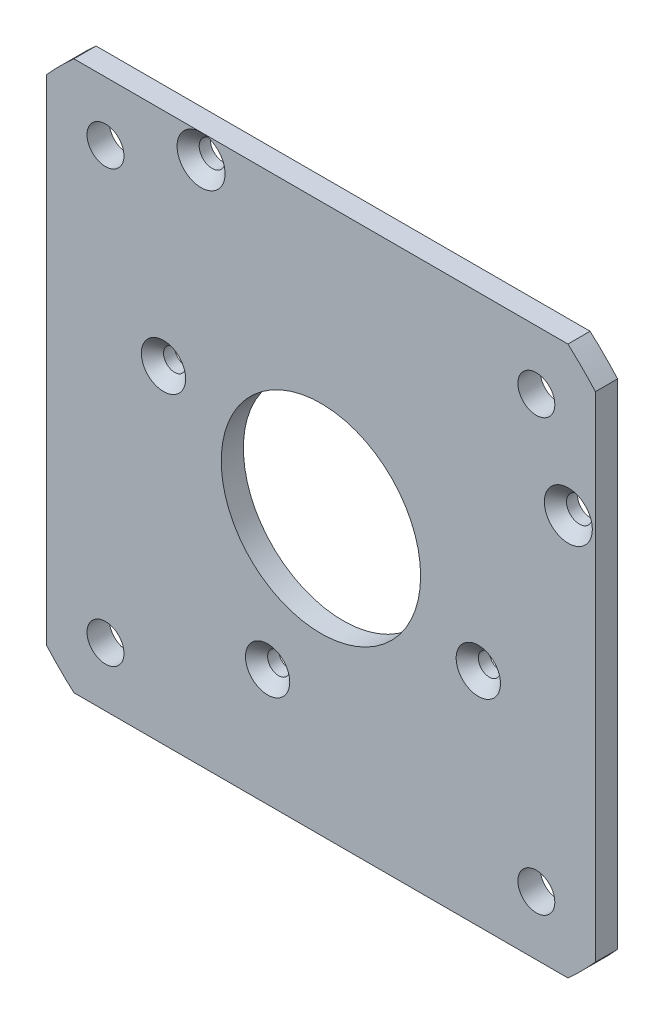
ISO-10303-21;
HEADER;
FILE_DESCRIPTION(('STEP AP214'),'2;1');
FILE_NAME('part.step','',(''),(''),'','','');
FILE_SCHEMA(('AUTOMOTIVE_DESIGN { 1 0 10303 214 1 1 1 1 }'));
ENDSEC;
DATA;
#1=APPLICATION_CONTEXT('core data for automotive mechanical design processes');
#2=APPLICATION_PROTOCOL_DEFINITION('international standard','automotive_design',2000,#1);
#3=PRODUCT_CONTEXT('',#1,'mechanical');
#4=PRODUCT('Part','Part','',(#3));
#5=PRODUCT_RELATED_PRODUCT_CATEGORY('part','',(#4));
#6=PRODUCT_DEFINITION_FORMATION('','',#4);
#7=PRODUCT_DEFINITION_CONTEXT('part definition',#1,'design');
#8=PRODUCT_DEFINITION('design','',#6,#7);
#9=PRODUCT_DEFINITION_SHAPE('','',#8);
#10=(LENGTH_UNIT() NAMED_UNIT(*) SI_UNIT(.MILLI.,.METRE.));
#11=(NAMED_UNIT(*) PLANE_ANGLE_UNIT() SI_UNIT($,.RADIAN.));
#12=(NAMED_UNIT(*) SI_UNIT($,.STERADIAN.) SOLID_ANGLE_UNIT());
#13=UNCERTAINTY_MEASURE_WITH_UNIT(LENGTH_MEASURE(1.E-05),#10,'distance_accuracy_value','');
#14=(GEOMETRIC_REPRESENTATION_CONTEXT(3) GLOBAL_UNCERTAINTY_ASSIGNED_CONTEXT((#13)) GLOBAL_UNIT_ASSIGNED_CONTEXT((#10,
#11,#12)) REPRESENTATION_CONTEXT('',''));
#15=CARTESIAN_POINT('',(0.,0.,0.));
#16=DIRECTION('',(0.,0.,1.));
#17=DIRECTION('',(1.,0.,0.));
#18=AXIS2_PLACEMENT_3D('',#15,#16,#17);
#19=CARTESIAN_POINT('',(0.,-1.66533453693773E-13,-6.00000000000001));
#20=DIRECTION('',(0.,0.,0.999999999999999));
#21=DIRECTION('',(1.,0.,0.));
#22=AXIS2_PLACEMENT_3D('',#19,#20,#21);
#23=CYLINDRICAL_SURFACE('',#22,100.);
#24=CARTESIAN_POINT('',(0.,-1.66533453693773E-13,0.));
#25=DIRECTION('',(0.,0.,0.999999999999999));
#26=DIRECTION('',(1.,0.,0.));
#27=AXIS2_PLACEMENT_3D('',#24,#25,#26);
#28=CIRCLE('',#27,100.);
#29=CARTESIAN_POINT('',(66.8888114535424,-74.3363094478902,1.38777878078145E-13));
#30=VERTEX_POINT('',#29);
#31=CARTESIAN_POINT('',(74.3363094478901,-66.8888114535425,1.38777878078145E-13));
#32=VERTEX_POINT('',#31);
#33=EDGE_CURVE('E144',#30,#32,#28,.T.);
#34=ORIENTED_EDGE('',*,*,#33,.F.);
#35=DIRECTION('',(0.,0.,0.999999999999999));
#36=VECTOR('',#35,1.);
#37=CARTESIAN_POINT('',(66.8888114535423,-74.3363094478902,-5.99999999999987));
#38=LINE('',#37,#36);
#39=CARTESIAN_POINT('',(66.8888114535423,-74.3363094478902,-5.99999999999987));
#40=VERTEX_POINT('',#39);
#41=EDGE_CURVE('E59',#40,#30,#38,.T.);
#42=ORIENTED_EDGE('',*,*,#41,.F.);
#43=CARTESIAN_POINT('',(0.,-1.66533453693773E-13,-6.00000000000001));
#44=DIRECTION('',(0.,0.,0.999999999999999));
#45=DIRECTION('',(1.,0.,0.));
#46=AXIS2_PLACEMENT_3D('',#43,#44,#45);
#47=CIRCLE('',#46,100.);
#48=CARTESIAN_POINT('',(74.3363094478901,-66.8888114535425,-5.99999999999987));
#49=VERTEX_POINT('',#48);
#50=EDGE_CURVE('E167',#40,#49,#47,.T.);
#51=ORIENTED_EDGE('',*,*,#50,.T.);
#52=DIRECTION('',(0.,0.,0.999999999999999));
#53=VECTOR('',#52,1.);
#54=CARTESIAN_POINT('',(74.3363094478901,-66.8888114535425,-5.99999999999987));
#55=LINE('',#54,#53);
#56=EDGE_CURVE('E97',#49,#32,#55,.T.);
#57=ORIENTED_EDGE('',*,*,#56,.T.);
#58=EDGE_LOOP('',(#34,#42,#51,#57));
#59=FACE_BOUND('',#58,.T.);
#60=ADVANCED_FACE('F38',(#59),#23,.T.);
#61=CARTESIAN_POINT('',(-66.8888114535423,-74.3363094478902,-5.99999999999998));
#62=DIRECTION('',(0.,-1.,0.));
#63=DIRECTION('',(0.,0.,-0.999999999999999));
#64=AXIS2_PLACEMENT_3D('',#61,#62,#63);
#65=PLANE('',#64);
#66=DIRECTION('',(1.,0.,0.));
#67=VECTOR('',#66,1.);
#68=CARTESIAN_POINT('',(-66.8888114535423,-74.3363094478902,0.));
#69=LINE('',#68,#67);
#70=CARTESIAN_POINT('',(-66.8888114535423,-74.3363094478902,0.));
#71=VERTEX_POINT('',#70);
#72=EDGE_CURVE('E164',#71,#30,#69,.T.);
#73=ORIENTED_EDGE('',*,*,#72,.F.);
#74=DIRECTION('',(0.,0.,0.999999999999999));
#75=VECTOR('',#74,1.);
#76=CARTESIAN_POINT('',(-66.8888114535423,-74.3363094478902,-5.99999999999998));
#77=LINE('',#76,#75);
#78=CARTESIAN_POINT('',(-66.8888114535423,-74.3363094478902,-5.99999999999998));
#79=VERTEX_POINT('',#78);
#80=EDGE_CURVE('E125',#79,#71,#77,.T.);
#81=ORIENTED_EDGE('',*,*,#80,.F.);
#82=DIRECTION('',(1.,0.,0.));
#83=VECTOR('',#82,1.);
#84=CARTESIAN_POINT('',(-66.8888114535423,-74.3363094478902,-5.99999999999998));
#85=LINE('',#84,#83);
#86=EDGE_CURVE('E134',#79,#40,#85,.T.);
#87=ORIENTED_EDGE('',*,*,#86,.T.);
#88=ORIENTED_EDGE('',*,*,#41,.T.);
#89=EDGE_LOOP('',(#73,#81,#87,#88));
#90=FACE_BOUND('',#89,.T.);
#91=ADVANCED_FACE('F220',(#90),#65,.T.);
#92=CARTESIAN_POINT('',(0.,-1.66533453693773E-13,-6.00000000000001));
#93=DIRECTION('',(0.,0.,0.999999999999999));
#94=DIRECTION('',(1.,0.,0.));
#95=AXIS2_PLACEMENT_3D('',#92,#93,#94);
#96=CYLINDRICAL_SURFACE('',#95,100.);
#97=CARTESIAN_POINT('',(0.,-1.66533453693773E-13,0.));
#98=DIRECTION('',(0.,0.,0.999999999999999));
#99=DIRECTION('',(1.,0.,0.));
#100=AXIS2_PLACEMENT_3D('',#97,#98,#99);
#101=CIRCLE('',#100,100.);
#102=CARTESIAN_POINT('',(-74.33630944789,-66.8888114535426,1.38777878078145E-13));
#103=VERTEX_POINT('',#102);
#104=EDGE_CURVE('E120',#103,#71,#101,.T.);
#105=ORIENTED_EDGE('',*,*,#104,.F.);
#106=DIRECTION('',(0.,0.,0.999999999999999));
#107=VECTOR('',#106,1.);
#108=CARTESIAN_POINT('',(-74.33630944789,-66.8888114535426,-5.99999999999987));
#109=LINE('',#108,#107);
#110=CARTESIAN_POINT('',(-74.33630944789,-66.8888114535426,-5.99999999999987));
#111=VERTEX_POINT('',#110);
#112=EDGE_CURVE('E114',#111,#103,#109,.T.);
#113=ORIENTED_EDGE('',*,*,#112,.F.);
#114=CARTESIAN_POINT('',(0.,-1.66533453693773E-13,-6.00000000000001));
#115=DIRECTION('',(0.,0.,0.999999999999999));
#116=DIRECTION('',(1.,0.,0.));
#117=AXIS2_PLACEMENT_3D('',#114,#115,#116);
#118=CIRCLE('',#117,100.);
#119=EDGE_CURVE('E117',#111,#79,#118,.T.);
#120=ORIENTED_EDGE('',*,*,#119,.T.);
#121=ORIENTED_EDGE('',*,*,#80,.T.);
#122=EDGE_LOOP('',(#105,#113,#120,#121));
#123=FACE_BOUND('',#122,.T.);
#124=ADVANCED_FACE('F116',(#123),#96,.T.);
#125=CARTESIAN_POINT('',(-74.33630944789,66.8888114535421,-5.99999999999973));
#126=DIRECTION('',(-1.,0.,0.));
#127=DIRECTION('',(0.,0.,0.999999999999999));
#128=AXIS2_PLACEMENT_3D('',#125,#126,#127);
#129=PLANE('',#128);
#130=DIRECTION('',(0.,-1.,0.));
#131=VECTOR('',#130,1.);
#132=CARTESIAN_POINT('',(-74.3363094478901,66.8888114535421,1.38777878078145E-13));
#133=LINE('',#132,#131);
#134=CARTESIAN_POINT('',(-74.3363094478901,66.8888114535421,1.38777878078145E-13));
#135=VERTEX_POINT('',#134);
#136=EDGE_CURVE('E161',#135,#103,#133,.T.);
#137=ORIENTED_EDGE('',*,*,#136,.F.);
#138=DIRECTION('',(0.,0.,0.999999999999999));
#139=VECTOR('',#138,1.);
#140=CARTESIAN_POINT('',(-74.33630944789,66.8888114535421,-5.99999999999973));
#141=LINE('',#140,#139);
#142=CARTESIAN_POINT('',(-74.33630944789,66.8888114535421,-5.99999999999973));
#143=VERTEX_POINT('',#142);
#144=EDGE_CURVE('E126',#143,#135,#141,.T.);
#145=ORIENTED_EDGE('',*,*,#144,.F.);
#146=DIRECTION('',(0.,-1.,0.));
#147=VECTOR('',#146,1.);
#148=CARTESIAN_POINT('',(-74.33630944789,66.8888114535421,-5.99999999999973));
#149=LINE('',#148,#147);
#150=EDGE_CURVE('E132',#143,#111,#149,.T.);
#151=ORIENTED_EDGE('',*,*,#150,.T.);
#152=ORIENTED_EDGE('',*,*,#112,.T.);
#153=EDGE_LOOP('',(#137,#145,#151,#152));
#154=FACE_BOUND('',#153,.T.);
#155=ADVANCED_FACE('F136',(#154),#129,.T.);
#156=CARTESIAN_POINT('',(0.,-1.66533453693773E-13,-6.00000000000001));
#157=DIRECTION('',(0.,0.,0.999999999999999));
#158=DIRECTION('',(1.,0.,0.));
#159=AXIS2_PLACEMENT_3D('',#156,#157,#158);
#160=CYLINDRICAL_SURFACE('',#159,100.);
#161=CARTESIAN_POINT('',(0.,-1.66533453693773E-13,0.));
#162=DIRECTION('',(0.,0.,0.999999999999999));
#163=DIRECTION('',(1.,0.,0.));
#164=AXIS2_PLACEMENT_3D('',#161,#162,#163);
#165=CIRCLE('',#164,100.);
#166=CARTESIAN_POINT('',(-66.888811453542,74.3363094478901,0.));
#167=VERTEX_POINT('',#166);
#168=EDGE_CURVE('E158',#167,#135,#165,.T.);
#169=ORIENTED_EDGE('',*,*,#168,.F.);
#170=DIRECTION('',(0.,0.,0.999999999999999));
#171=VECTOR('',#170,1.);
#172=CARTESIAN_POINT('',(-66.888811453542,74.3363094478901,-6.00000000000001));
#173=LINE('',#172,#171);
#174=CARTESIAN_POINT('',(-66.888811453542,74.3363094478901,-6.00000000000001));
#175=VERTEX_POINT('',#174);
#176=EDGE_CURVE('E172',#175,#167,#173,.T.);
#177=ORIENTED_EDGE('',*,*,#176,.F.);
#178=CARTESIAN_POINT('',(0.,-1.66533453693773E-13,-6.00000000000001));
#179=DIRECTION('',(0.,0.,0.999999999999999));
#180=DIRECTION('',(1.,0.,0.));
#181=AXIS2_PLACEMENT_3D('',#178,#179,#180);
#182=CIRCLE('',#181,100.);
#183=EDGE_CURVE('E137',#175,#143,#182,.T.);
#184=ORIENTED_EDGE('',*,*,#183,.T.);
#185=ORIENTED_EDGE('',*,*,#144,.T.);
#186=EDGE_LOOP('',(#169,#177,#184,#185));
#187=FACE_BOUND('',#186,.T.);
#188=ADVANCED_FACE('F313',(#187),#160,.T.);
#189=CARTESIAN_POINT('',(66.888811453542,74.3363094478902,-5.99999999999987));
#190=DIRECTION('',(0.,1.,0.));
#191=DIRECTION('',(0.,0.,0.999999999999999));
#192=AXIS2_PLACEMENT_3D('',#189,#190,#191);
#193=PLANE('',#192);
#194=DIRECTION('',(-1.,0.,0.));
#195=VECTOR('',#194,1.);
#196=CARTESIAN_POINT('',(66.888811453542,74.3363094478902,1.38777878078145E-13));
#197=LINE('',#196,#195);
#198=CARTESIAN_POINT('',(66.888811453542,74.3363094478902,1.38777878078145E-13));
#199=VERTEX_POINT('',#198);
#200=CARTESIAN_POINT('',(-32.454521270979,74.3363094478902,1.38777878078145E-13));
#201=VERTEX_POINT('',#200);
#202=EDGE_CURVE('E155',#199,#201,#197,.T.);
#203=ORIENTED_EDGE('',*,*,#202,.F.);
#204=DIRECTION('',(0.,0.,0.999999999999999));
#205=VECTOR('',#204,1.);
#206=CARTESIAN_POINT('',(66.888811453542,74.3363094478902,-5.99999999999987));
#207=LINE('',#206,#205);
#208=CARTESIAN_POINT('',(66.888811453542,74.3363094478902,-5.99999999999987));
#209=VERTEX_POINT('',#208);
#210=EDGE_CURVE('E175',#209,#199,#207,.T.);
#211=ORIENTED_EDGE('',*,*,#210,.F.);
#212=DIRECTION('',(-1.,0.,0.));
#213=VECTOR('',#212,1.);
#214=CARTESIAN_POINT('',(66.888811453542,74.3363094478902,-5.99999999999987));
#215=LINE('',#214,#213);
#216=EDGE_CURVE('E139',#209,#175,#215,.T.);
#217=ORIENTED_EDGE('',*,*,#216,.T.);
#218=ORIENTED_EDGE('',*,*,#176,.T.);
#219=EDGE_CURVE('E154',#201,#167,#197,.T.);
#220=ORIENTED_EDGE('',*,*,#219,.F.);
#221=EDGE_LOOP('',(#203,#211,#217,#218,#220));
#222=FACE_BOUND('',#221,.T.);
#223=ADVANCED_FACE('F303',(#222),#193,.T.);
#224=CARTESIAN_POINT('',(0.,-1.66533453693773E-13,-6.00000000000001));
#225=DIRECTION('',(0.,0.,0.999999999999999));
#226=DIRECTION('',(1.,0.,0.));
#227=AXIS2_PLACEMENT_3D('',#224,#225,#226);
#228=CYLINDRICAL_SURFACE('',#227,100.);
#229=CARTESIAN_POINT('',(0.,-1.66533453693773E-13,0.));
#230=DIRECTION('',(0.,0.,0.999999999999999));
#231=DIRECTION('',(1.,0.,0.));
#232=AXIS2_PLACEMENT_3D('',#229,#230,#231);
#233=CIRCLE('',#232,100.);
#234=CARTESIAN_POINT('',(74.33630944789,66.8888114535421,1.38777878078145E-13));
#235=VERTEX_POINT('',#234);
#236=EDGE_CURVE('E151',#235,#199,#233,.T.);
#237=ORIENTED_EDGE('',*,*,#236,.F.);
#238=DIRECTION('',(0.,0.,0.999999999999999));
#239=VECTOR('',#238,1.);
#240=CARTESIAN_POINT('',(74.33630944789,66.8888114535421,-5.99999999999987));
#241=LINE('',#240,#239);
#242=CARTESIAN_POINT('',(74.33630944789,66.8888114535421,-5.99999999999987));
#243=VERTEX_POINT('',#242);
#244=EDGE_CURVE('E177',#243,#235,#241,.T.);
#245=ORIENTED_EDGE('',*,*,#244,.F.);
#246=CARTESIAN_POINT('',(0.,-1.66533453693773E-13,-6.00000000000001));
#247=DIRECTION('',(0.,0.,0.999999999999999));
#248=DIRECTION('',(1.,0.,0.));
#249=AXIS2_PLACEMENT_3D('',#246,#247,#248);
#250=CIRCLE('',#249,100.);
#251=EDGE_CURVE('E297',#243,#209,#250,.T.);
#252=ORIENTED_EDGE('',*,*,#251,.T.);
#253=ORIENTED_EDGE('',*,*,#210,.T.);
#254=EDGE_LOOP('',(#237,#245,#252,#253));
#255=FACE_BOUND('',#254,.T.);
#256=ADVANCED_FACE('F309',(#255),#228,.T.);
#257=CARTESIAN_POINT('',(74.3363094478901,-66.8888114535425,-5.99999999999987));
#258=DIRECTION('',(1.,0.,0.));
#259=DIRECTION('',(0.,0.,-0.999999999999999));
#260=AXIS2_PLACEMENT_3D('',#257,#258,#259);
#261=PLANE('',#260);
#262=DIRECTION('',(0.,1.,0.));
#263=VECTOR('',#262,1.);
#264=CARTESIAN_POINT('',(74.3363094478901,-66.8888114535425,1.38777878078145E-13));
#265=LINE('',#264,#263);
#266=EDGE_CURVE('E147',#32,#235,#265,.T.);
#267=ORIENTED_EDGE('',*,*,#266,.F.);
#268=ORIENTED_EDGE('',*,*,#56,.F.);
#269=DIRECTION('',(0.,1.,0.));
#270=VECTOR('',#269,1.);
#271=CARTESIAN_POINT('',(74.3363094478901,-66.8888114535425,-5.99999999999987));
#272=LINE('',#271,#270);
#273=EDGE_CURVE('E295',#49,#243,#272,.T.);
#274=ORIENTED_EDGE('',*,*,#273,.T.);
#275=ORIENTED_EDGE('',*,*,#244,.T.);
#276=EDGE_LOOP('',(#267,#268,#274,#275));
#277=FACE_BOUND('',#276,.T.);
#278=ADVANCED_FACE('F228',(#277),#261,.T.);
#279=CARTESIAN_POINT('',(0.,-1.66533453693773E-13,-6.00000000000001));
#280=DIRECTION('',(0.,0.,0.999999999999999));
#281=DIRECTION('',(1.,0.,0.));
#282=AXIS2_PLACEMENT_3D('',#279,#280,#281);
#283=PLANE('',#282);
#284=CARTESIAN_POINT('',(-32.4545212709791,67.8363094478902,-5.99999999999973));
#285=DIRECTION('',(0.,0.,0.999999999999999));
#286=DIRECTION('',(1.,0.,0.));
#287=AXIS2_PLACEMENT_3D('',#284,#285,#286);
#288=CIRCLE('',#287,3.50000000000002);
#289=CARTESIAN_POINT('',(-28.9545212709791,67.8363094478902,-5.99999999999973));
#290=VERTEX_POINT('',#289);
#291=EDGE_CURVE('E251',#290,#290,#288,.T.);
#292=ORIENTED_EDGE('',*,*,#291,.T.);
#293=EDGE_LOOP('',(#292));
#294=FACE_BOUND('',#293,.T.);
#295=CARTESIAN_POINT('',(-42.6219051351722,14.4351377772567,-6.00000000000001));
#296=DIRECTION('',(0.,0.,0.999999999999999));
#297=DIRECTION('',(1.,0.,0.));
#298=AXIS2_PLACEMENT_3D('',#295,#296,#297);
#299=CIRCLE('',#298,3.);
#300=CARTESIAN_POINT('',(-39.6219051351721,14.4351377772567,-6.00000000000001));
#301=VERTEX_POINT('',#300);
#302=EDGE_CURVE('E249',#301,#301,#299,.T.);
#303=ORIENTED_EDGE('',*,*,#302,.T.);
#304=EDGE_LOOP('',(#303));
#305=FACE_BOUND('',#304,.T.);
#306=CARTESIAN_POINT('',(-14.4351377772567,-42.6219051351723,-5.99999999999987));
#307=DIRECTION('',(0.,0.,0.999999999999999));
#308=DIRECTION('',(1.,0.,0.));
#309=AXIS2_PLACEMENT_3D('',#306,#307,#308);
#310=CIRCLE('',#309,3.);
#311=CARTESIAN_POINT('',(-11.4351377772567,-42.6219051351723,-5.99999999999987));
#312=VERTEX_POINT('',#311);
#313=EDGE_CURVE('E252',#312,#312,#310,.T.);
#314=ORIENTED_EDGE('',*,*,#313,.T.);
#315=EDGE_LOOP('',(#314));
#316=FACE_BOUND('',#315,.T.);
#317=CARTESIAN_POINT('',(42.6219051351721,-14.4351377772568,-5.99999999999987));
#318=DIRECTION('',(0.,0.,0.999999999999999));
#319=DIRECTION('',(1.,0.,0.));
#320=AXIS2_PLACEMENT_3D('',#317,#318,#319);
#321=CIRCLE('',#320,3.);
#322=CARTESIAN_POINT('',(45.6219051351721,-14.4351377772568,-5.99999999999987));
#323=VERTEX_POINT('',#322);
#324=EDGE_CURVE('E258',#323,#323,#321,.T.);
#325=ORIENTED_EDGE('',*,*,#324,.T.);
#326=EDGE_LOOP('',(#325));
#327=FACE_BOUND('',#326,.T.);
#328=CARTESIAN_POINT('',(66.9965907110898,34.1543213009582,-5.99999999999984));
#329=DIRECTION('',(0.,0.,0.999999999999999));
#330=DIRECTION('',(1.,0.,0.));
#331=AXIS2_PLACEMENT_3D('',#328,#329,#330);
#332=CIRCLE('',#331,3.50000000000001);
#333=CARTESIAN_POINT('',(70.4965907110898,34.1543213009582,-5.99999999999984));
#334=VERTEX_POINT('',#333);
#335=EDGE_CURVE('E263',#334,#334,#332,.T.);
#336=ORIENTED_EDGE('',*,*,#335,.T.);
#337=EDGE_LOOP('',(#336));
#338=FACE_BOUND('',#337,.T.);
#339=CARTESIAN_POINT('',(0.,-1.38777878078145E-13,-6.00000000000001));
#340=DIRECTION('',(0.,0.,0.999999999999999));
#341=DIRECTION('',(1.,0.,0.));
#342=AXIS2_PLACEMENT_3D('',#339,#340,#341);
#343=CIRCLE('',#342,27.);
#344=CARTESIAN_POINT('',(27.,-1.38777878078145E-13,-6.00000000000001));
#345=VERTEX_POINT('',#344);
#346=EDGE_CURVE('E266',#345,#345,#343,.T.);
#347=ORIENTED_EDGE('',*,*,#346,.T.);
#348=EDGE_LOOP('',(#347));
#349=FACE_BOUND('',#348,.T.);
#350=CARTESIAN_POINT('',(58.33630944789,-58.3363094478905,-6.00000000000001));
#351=DIRECTION('',(0.,0.,0.999999999999999));
#352=DIRECTION('',(1.,0.,0.));
#353=AXIS2_PLACEMENT_3D('',#350,#351,#352);
#354=CIRCLE('',#353,4.99999999999999);
#355=CARTESIAN_POINT('',(63.33630944789,-58.3363094478905,-6.00000000000001));
#356=VERTEX_POINT('',#355);
#357=EDGE_CURVE('E272',#356,#356,#354,.T.);
#358=ORIENTED_EDGE('',*,*,#357,.T.);
#359=EDGE_LOOP('',(#358));
#360=FACE_BOUND('',#359,.T.);
#361=CARTESIAN_POINT('',(58.3363094478903,58.3363094478899,-5.99999999999987));
#362=DIRECTION('',(0.,0.,0.999999999999999));
#363=DIRECTION('',(1.,0.,0.));
#364=AXIS2_PLACEMENT_3D('',#361,#362,#363);
#365=CIRCLE('',#364,4.99999999999997);
#366=CARTESIAN_POINT('',(63.3363094478903,58.3363094478899,-5.99999999999987));
#367=VERTEX_POINT('',#366);
#368=EDGE_CURVE('E278',#367,#367,#365,.T.);
#369=ORIENTED_EDGE('',*,*,#368,.T.);
#370=EDGE_LOOP('',(#369));
#371=FACE_BOUND('',#370,.T.);
#372=CARTESIAN_POINT('',(-58.33630944789,58.3363094478901,-5.99999999999987));
#373=DIRECTION('',(0.,0.,0.999999999999999));
#374=DIRECTION('',(1.,0.,0.));
#375=AXIS2_PLACEMENT_3D('',#372,#373,#374);
#376=CIRCLE('',#375,5.00000000000001);
#377=CARTESIAN_POINT('',(-53.33630944789,58.3363094478901,-5.99999999999987));
#378=VERTEX_POINT('',#377);
#379=EDGE_CURVE('E284',#378,#378,#376,.T.);
#380=ORIENTED_EDGE('',*,*,#379,.T.);
#381=EDGE_LOOP('',(#380));
#382=FACE_BOUND('',#381,.T.);
#383=CARTESIAN_POINT('',(-58.3363094478903,-58.3363094478902,-6.00000000000001));
#384=DIRECTION('',(0.,0.,0.999999999999999));
#385=DIRECTION('',(1.,0.,0.));
#386=AXIS2_PLACEMENT_3D('',#383,#384,#385);
#387=CIRCLE('',#386,4.99999999999999);
#388=CARTESIAN_POINT('',(-53.3363094478903,-58.3363094478902,-6.00000000000001));
#389=VERTEX_POINT('',#388);
#390=EDGE_CURVE('E148',#389,#389,#387,.T.);
#391=ORIENTED_EDGE('',*,*,#390,.T.);
#392=EDGE_LOOP('',(#391));
#393=FACE_BOUND('',#392,.T.);
#394=ORIENTED_EDGE('',*,*,#50,.F.);
#395=ORIENTED_EDGE('',*,*,#86,.F.);
#396=ORIENTED_EDGE('',*,*,#119,.F.);
#397=ORIENTED_EDGE('',*,*,#150,.F.);
#398=ORIENTED_EDGE('',*,*,#183,.F.);
#399=ORIENTED_EDGE('',*,*,#216,.F.);
#400=ORIENTED_EDGE('',*,*,#251,.F.);
#401=ORIENTED_EDGE('',*,*,#273,.F.);
#402=EDGE_LOOP('',(#394,#395,#396,#397,#398,#399,#400,#401));
#403=FACE_BOUND('',#402,.T.);
#404=ADVANCED_FACE('F130',(#294,#305,#316,#327,#338,#349,#360,#371,#382,#393,#403),#283,.F.);
#405=CARTESIAN_POINT('',(0.,-1.66533453693773E-13,0.));
#406=DIRECTION('',(0.,0.,0.999999999999999));
#407=DIRECTION('',(1.,0.,0.));
#408=AXIS2_PLACEMENT_3D('',#405,#406,#407);
#409=PLANE('',#408);
#410=CARTESIAN_POINT('',(-42.6219051351722,14.4351377772566,0.));
#411=DIRECTION('',(0.,0.,0.999999999999999));
#412=DIRECTION('',(1.,0.,0.));
#413=AXIS2_PLACEMENT_3D('',#410,#411,#412);
#414=CIRCLE('',#413,6.00000000000003);
#415=CARTESIAN_POINT('',(-36.6219051351721,14.4351377772566,0.));
#416=VERTEX_POINT('',#415);
#417=EDGE_CURVE('E191',#416,#416,#414,.F.);
#418=ORIENTED_EDGE('',*,*,#417,.T.);
#419=EDGE_LOOP('',(#418));
#420=FACE_BOUND('',#419,.T.);
#421=CARTESIAN_POINT('',(-14.4351377772567,-42.6219051351723,1.38777878078145E-13));
#422=DIRECTION('',(0.,0.,0.999999999999999));
#423=DIRECTION('',(1.,0.,0.));
#424=AXIS2_PLACEMENT_3D('',#421,#422,#423);
#425=CIRCLE('',#424,6.00000000000003);
#426=CARTESIAN_POINT('',(-8.43513777725664,-42.6219051351723,1.38777878078145E-13));
#427=VERTEX_POINT('',#426);
#428=EDGE_CURVE('E188',#427,#427,#425,.F.);
#429=ORIENTED_EDGE('',*,*,#428,.T.);
#430=EDGE_LOOP('',(#429));
#431=FACE_BOUND('',#430,.T.);
#432=CARTESIAN_POINT('',(42.6219051351722,-14.4351377772568,1.38777878078145E-13));
#433=DIRECTION('',(0.,0.,0.999999999999999));
#434=DIRECTION('',(1.,0.,0.));
#435=AXIS2_PLACEMENT_3D('',#432,#433,#434);
#436=CIRCLE('',#435,6.00000000000003);
#437=CARTESIAN_POINT('',(48.6219051351722,-14.4351377772568,1.38777878078145E-13));
#438=VERTEX_POINT('',#437);
#439=EDGE_CURVE('E185',#438,#438,#436,.F.);
#440=ORIENTED_EDGE('',*,*,#439,.T.);
#441=EDGE_LOOP('',(#440));
#442=FACE_BOUND('',#441,.T.);
#443=CARTESIAN_POINT('',(66.9965907110898,34.1543213009582,1.38777878078145E-13));
#444=DIRECTION('',(0.,0.,0.999999999999999));
#445=DIRECTION('',(1.,0.,0.));
#446=AXIS2_PLACEMENT_3D('',#443,#444,#445);
#447=CIRCLE('',#446,6.50000000000001);
#448=CARTESIAN_POINT('',(73.4965907110898,34.1543213009582,1.38777878078145E-13));
#449=VERTEX_POINT('',#448);
#450=EDGE_CURVE('E182',#449,#449,#447,.F.);
#451=ORIENTED_EDGE('',*,*,#450,.T.);
#452=EDGE_LOOP('',(#451));
#453=FACE_BOUND('',#452,.T.);
#454=CARTESIAN_POINT('',(0.,-1.52655665885959E-13,0.));
#455=DIRECTION('',(0.,0.,0.999999999999999));
#456=DIRECTION('',(1.,0.,0.));
#457=AXIS2_PLACEMENT_3D('',#454,#455,#456);
#458=CIRCLE('',#457,27.);
#459=CARTESIAN_POINT('',(27.,-1.52655665885959E-13,0.));
#460=VERTEX_POINT('',#459);
#461=EDGE_CURVE('E255',#460,#460,#458,.T.);
#462=ORIENTED_EDGE('',*,*,#461,.F.);
#463=EDGE_LOOP('',(#462));
#464=FACE_BOUND('',#463,.T.);
#465=CARTESIAN_POINT('',(58.3363094478901,-58.3363094478905,0.));
#466=DIRECTION('',(0.,0.,0.999999999999999));
#467=DIRECTION('',(1.,0.,0.));
#468=AXIS2_PLACEMENT_3D('',#465,#466,#467);
#469=CIRCLE('',#468,4.99999999999999);
#470=CARTESIAN_POINT('',(63.3363094478901,-58.3363094478905,0.));
#471=VERTEX_POINT('',#470);
#472=EDGE_CURVE('E269',#471,#471,#469,.T.);
#473=ORIENTED_EDGE('',*,*,#472,.F.);
#474=EDGE_LOOP('',(#473));
#475=FACE_BOUND('',#474,.T.);
#476=CARTESIAN_POINT('',(58.3363094478902,58.3363094478899,1.38777878078145E-13));
#477=DIRECTION('',(0.,0.,0.999999999999999));
#478=DIRECTION('',(1.,0.,0.));
#479=AXIS2_PLACEMENT_3D('',#476,#477,#478);
#480=CIRCLE('',#479,4.99999999999997);
#481=CARTESIAN_POINT('',(63.3363094478902,58.3363094478899,1.38777878078145E-13));
#482=VERTEX_POINT('',#481);
#483=EDGE_CURVE('E275',#482,#482,#480,.T.);
#484=ORIENTED_EDGE('',*,*,#483,.F.);
#485=EDGE_LOOP('',(#484));
#486=FACE_BOUND('',#485,.T.);
#487=CARTESIAN_POINT('',(-58.33630944789,58.3363094478901,1.38777878078145E-13));
#488=DIRECTION('',(0.,0.,0.999999999999999));
#489=DIRECTION('',(1.,0.,0.));
#490=AXIS2_PLACEMENT_3D('',#487,#488,#489);
#491=CIRCLE('',#490,5.00000000000001);
#492=CARTESIAN_POINT('',(-53.33630944789,58.3363094478901,1.38777878078145E-13));
#493=VERTEX_POINT('',#492);
#494=EDGE_CURVE('E281',#493,#493,#491,.T.);
#495=ORIENTED_EDGE('',*,*,#494,.F.);
#496=EDGE_LOOP('',(#495));
#497=FACE_BOUND('',#496,.T.);
#498=CARTESIAN_POINT('',(-58.3363094478903,-58.3363094478902,0.));
#499=DIRECTION('',(0.,0.,0.999999999999999));
#500=DIRECTION('',(1.,0.,0.));
#501=AXIS2_PLACEMENT_3D('',#498,#499,#500);
#502=CIRCLE('',#501,4.99999999999999);
#503=CARTESIAN_POINT('',(-53.3363094478903,-58.3363094478902,0.));
#504=VERTEX_POINT('',#503);
#505=EDGE_CURVE('E287',#504,#504,#502,.T.);
#506=ORIENTED_EDGE('',*,*,#505,.F.);
#507=EDGE_LOOP('',(#506));
#508=FACE_BOUND('',#507,.T.);
#509=ORIENTED_EDGE('',*,*,#202,.T.);
#510=CARTESIAN_POINT('',(-32.4545212709791,67.8363094478902,2.77555756156289E-13));
#511=DIRECTION('',(0.,0.,0.999999999999999));
#512=DIRECTION('',(1.,0.,0.));
#513=AXIS2_PLACEMENT_3D('',#510,#511,#512);
#514=CIRCLE('',#513,6.50000000000001);
#515=EDGE_CURVE('E51',#201,#201,#514,.F.);
#516=ORIENTED_EDGE('',*,*,#515,.T.);
#517=ORIENTED_EDGE('',*,*,#219,.T.);
#518=ORIENTED_EDGE('',*,*,#168,.T.);
#519=ORIENTED_EDGE('',*,*,#136,.T.);
#520=ORIENTED_EDGE('',*,*,#104,.T.);
#521=ORIENTED_EDGE('',*,*,#72,.T.);
#522=ORIENTED_EDGE('',*,*,#33,.T.);
#523=ORIENTED_EDGE('',*,*,#266,.T.);
#524=ORIENTED_EDGE('',*,*,#236,.T.);
#525=EDGE_LOOP('',(#509,#516,#517,#518,#519,#520,#521,#522,#523,#524));
#526=FACE_BOUND('',#525,.T.);
#527=ADVANCED_FACE('F311',(#420,#431,#442,#453,#464,#475,#486,#497,#508,#526),#409,.T.);
#528=CARTESIAN_POINT('',(-58.3363094478903,-58.3363094478902,-6.00000000000001));
#529=DIRECTION('',(0.,0.,0.999999999999999));
#530=DIRECTION('',(1.,0.,0.));
#531=AXIS2_PLACEMENT_3D('',#528,#529,#530);
#532=CYLINDRICAL_SURFACE('',#531,4.99999999999999);
#533=ORIENTED_EDGE('',*,*,#390,.F.);
#534=EDGE_LOOP('',(#533));
#535=FACE_BOUND('',#534,.T.);
#536=ORIENTED_EDGE('',*,*,#505,.T.);
#537=EDGE_LOOP('',(#536));
#538=FACE_BOUND('',#537,.T.);
#539=ADVANCED_FACE('F335',(#535,#538),#532,.F.);
#540=CARTESIAN_POINT('',(-58.33630944789,58.3363094478901,-5.99999999999987));
#541=DIRECTION('',(0.,0.,0.999999999999999));
#542=DIRECTION('',(1.,0.,0.));
#543=AXIS2_PLACEMENT_3D('',#540,#541,#542);
#544=CYLINDRICAL_SURFACE('',#543,5.00000000000001);
#545=ORIENTED_EDGE('',*,*,#379,.F.);
#546=EDGE_LOOP('',(#545));
#547=FACE_BOUND('',#546,.T.);
#548=ORIENTED_EDGE('',*,*,#494,.T.);
#549=EDGE_LOOP('',(#548));
#550=FACE_BOUND('',#549,.T.);
#551=ADVANCED_FACE('F388',(#547,#550),#544,.F.);
#552=CARTESIAN_POINT('',(58.3363094478903,58.3363094478899,-5.99999999999987));
#553=DIRECTION('',(0.,0.,0.999999999999999));
#554=DIRECTION('',(1.,0.,0.));
#555=AXIS2_PLACEMENT_3D('',#552,#553,#554);
#556=CYLINDRICAL_SURFACE('',#555,4.99999999999997);
#557=ORIENTED_EDGE('',*,*,#368,.F.);
#558=EDGE_LOOP('',(#557));
#559=FACE_BOUND('',#558,.T.);
#560=ORIENTED_EDGE('',*,*,#483,.T.);
#561=EDGE_LOOP('',(#560));
#562=FACE_BOUND('',#561,.T.);
#563=ADVANCED_FACE('F397',(#559,#562),#556,.F.);
#564=CARTESIAN_POINT('',(58.33630944789,-58.3363094478905,-6.00000000000001));
#565=DIRECTION('',(0.,0.,0.999999999999999));
#566=DIRECTION('',(1.,0.,0.));
#567=AXIS2_PLACEMENT_3D('',#564,#565,#566);
#568=CYLINDRICAL_SURFACE('',#567,4.99999999999999);
#569=ORIENTED_EDGE('',*,*,#357,.F.);
#570=EDGE_LOOP('',(#569));
#571=FACE_BOUND('',#570,.T.);
#572=ORIENTED_EDGE('',*,*,#472,.T.);
#573=EDGE_LOOP('',(#572));
#574=FACE_BOUND('',#573,.T.);
#575=ADVANCED_FACE('F406',(#571,#574),#568,.F.);
#576=CARTESIAN_POINT('',(0.,-1.38777878078145E-13,-6.00000000000001));
#577=DIRECTION('',(0.,0.,0.999999999999999));
#578=DIRECTION('',(1.,0.,0.));
#579=AXIS2_PLACEMENT_3D('',#576,#577,#578);
#580=CYLINDRICAL_SURFACE('',#579,27.);
#581=ORIENTED_EDGE('',*,*,#346,.F.);
#582=EDGE_LOOP('',(#581));
#583=FACE_BOUND('',#582,.T.);
#584=ORIENTED_EDGE('',*,*,#461,.T.);
#585=EDGE_LOOP('',(#584));
#586=FACE_BOUND('',#585,.T.);
#587=ADVANCED_FACE('F416',(#583,#586),#580,.F.);
#588=CARTESIAN_POINT('',(66.9965907110898,34.1543213009582,-5.99999999999984));
#589=DIRECTION('',(0.,0.,0.999999999999999));
#590=DIRECTION('',(1.,0.,0.));
#591=AXIS2_PLACEMENT_3D('',#588,#589,#590);
#592=CYLINDRICAL_SURFACE('',#591,3.50000000000001);
#593=CARTESIAN_POINT('',(66.9965907110898,34.1543213009582,-2.99999999999984));
#594=DIRECTION('',(0.,0.,0.999999999999999));
#595=DIRECTION('',(1.,0.,0.));
#596=AXIS2_PLACEMENT_3D('',#593,#594,#595);
#597=CIRCLE('',#596,3.50000000000001);
#598=CARTESIAN_POINT('',(70.4965907110898,34.1543213009582,-2.99999999999984));
#599=VERTEX_POINT('',#598);
#600=EDGE_CURVE('E11',#599,#599,#597,.T.);
#601=ORIENTED_EDGE('',*,*,#600,.T.);
#602=EDGE_LOOP('',(#601));
#603=FACE_BOUND('',#602,.T.);
#604=ORIENTED_EDGE('',*,*,#335,.F.);
#605=EDGE_LOOP('',(#604));
#606=FACE_BOUND('',#605,.T.);
#607=ADVANCED_FACE('F426',(#603,#606),#592,.F.);
#608=CARTESIAN_POINT('',(42.6219051351721,-14.4351377772568,-5.99999999999987));
#609=DIRECTION('',(0.,0.,0.999999999999999));
#610=DIRECTION('',(1.,0.,0.));
#611=AXIS2_PLACEMENT_3D('',#608,#609,#610);
#612=CYLINDRICAL_SURFACE('',#611,3.);
#613=CARTESIAN_POINT('',(42.6219051351721,-14.4351377772568,-2.99999999999986));
#614=DIRECTION('',(0.,0.,0.999999999999999));
#615=DIRECTION('',(1.,0.,0.));
#616=AXIS2_PLACEMENT_3D('',#613,#614,#615);
#617=CIRCLE('',#616,3.);
#618=CARTESIAN_POINT('',(45.6219051351721,-14.4351377772568,-2.99999999999986));
#619=VERTEX_POINT('',#618);
#620=EDGE_CURVE('E46',#619,#619,#617,.T.);
#621=ORIENTED_EDGE('',*,*,#620,.T.);
#622=EDGE_LOOP('',(#621));
#623=FACE_BOUND('',#622,.T.);
#624=ORIENTED_EDGE('',*,*,#324,.F.);
#625=EDGE_LOOP('',(#624));
#626=FACE_BOUND('',#625,.T.);
#627=ADVANCED_FACE('F203',(#623,#626),#612,.F.);
#628=CARTESIAN_POINT('',(-14.4351377772567,-42.6219051351723,-5.99999999999987));
#629=DIRECTION('',(0.,0.,0.999999999999999));
#630=DIRECTION('',(1.,0.,0.));
#631=AXIS2_PLACEMENT_3D('',#628,#629,#630);
#632=CYLINDRICAL_SURFACE('',#631,3.);
#633=CARTESIAN_POINT('',(-14.4351377772568,-42.6219051351723,-2.99999999999986));
#634=DIRECTION('',(0.,0.,0.999999999999999));
#635=DIRECTION('',(1.,0.,0.));
#636=AXIS2_PLACEMENT_3D('',#633,#634,#635);
#637=CIRCLE('',#636,3.);
#638=CARTESIAN_POINT('',(-11.4351377772568,-42.6219051351723,-2.99999999999986));
#639=VERTEX_POINT('',#638);
#640=EDGE_CURVE('E198',#639,#639,#637,.T.);
#641=ORIENTED_EDGE('',*,*,#640,.T.);
#642=EDGE_LOOP('',(#641));
#643=FACE_BOUND('',#642,.T.);
#644=ORIENTED_EDGE('',*,*,#313,.F.);
#645=EDGE_LOOP('',(#644));
#646=FACE_BOUND('',#645,.T.);
#647=ADVANCED_FACE('F245',(#643,#646),#632,.F.);
#648=CARTESIAN_POINT('',(-42.6219051351722,14.4351377772567,-6.00000000000001));
#649=DIRECTION('',(0.,0.,0.999999999999999));
#650=DIRECTION('',(1.,0.,0.));
#651=AXIS2_PLACEMENT_3D('',#648,#649,#650);
#652=CYLINDRICAL_SURFACE('',#651,3.);
#653=CARTESIAN_POINT('',(-42.6219051351722,14.4351377772567,-3.00000000000003));
#654=DIRECTION('',(0.,0.,0.999999999999999));
#655=DIRECTION('',(1.,0.,0.));
#656=AXIS2_PLACEMENT_3D('',#653,#654,#655);
#657=CIRCLE('',#656,3.);
#658=CARTESIAN_POINT('',(-39.6219051351721,14.4351377772567,-3.00000000000003));
#659=VERTEX_POINT('',#658);
#660=EDGE_CURVE('E195',#659,#659,#657,.T.);
#661=ORIENTED_EDGE('',*,*,#660,.T.);
#662=EDGE_LOOP('',(#661));
#663=FACE_BOUND('',#662,.T.);
#664=ORIENTED_EDGE('',*,*,#302,.F.);
#665=EDGE_LOOP('',(#664));
#666=FACE_BOUND('',#665,.T.);
#667=ADVANCED_FACE('F242',(#663,#666),#652,.F.);
#668=CARTESIAN_POINT('',(-32.4545212709791,67.8363094478902,-5.99999999999973));
#669=DIRECTION('',(0.,0.,0.999999999999999));
#670=DIRECTION('',(1.,0.,0.));
#671=AXIS2_PLACEMENT_3D('',#668,#669,#670);
#672=CYLINDRICAL_SURFACE('',#671,3.50000000000002);
#673=CARTESIAN_POINT('',(-32.4545212709791,67.8363094478902,-2.9999999999997));
#674=DIRECTION('',(0.,0.,0.999999999999999));
#675=DIRECTION('',(1.,0.,0.));
#676=AXIS2_PLACEMENT_3D('',#673,#674,#675);
#677=CIRCLE('',#676,3.50000000000002);
#678=CARTESIAN_POINT('',(-28.9545212709791,67.8363094478902,-2.9999999999997));
#679=VERTEX_POINT('',#678);
#680=EDGE_CURVE('E169',#679,#679,#677,.T.);
#681=ORIENTED_EDGE('',*,*,#680,.T.);
#682=EDGE_LOOP('',(#681));
#683=FACE_BOUND('',#682,.T.);
#684=ORIENTED_EDGE('',*,*,#291,.F.);
#685=EDGE_LOOP('',(#684));
#686=FACE_BOUND('',#685,.T.);
#687=ADVANCED_FACE('F233',(#683,#686),#672,.F.);
#688=CARTESIAN_POINT('',(-32.4545212709791,67.8363094478902,-2.9999999999997));
#689=DIRECTION('',(0.,0.,0.999999999999999));
#690=DIRECTION('',(1.,0.,0.));
#691=AXIS2_PLACEMENT_3D('',#688,#689,#690);
#692=CONICAL_SURFACE('',#691,3.50000000000002,0.785398163397451);
#693=ORIENTED_EDGE('',*,*,#515,.F.);
#694=EDGE_LOOP('',(#693));
#695=FACE_BOUND('',#694,.T.);
#696=ORIENTED_EDGE('',*,*,#680,.F.);
#697=EDGE_LOOP('',(#696));
#698=FACE_BOUND('',#697,.T.);
#699=ADVANCED_FACE('F230',(#695,#698),#692,.F.);
#700=CARTESIAN_POINT('',(-42.6219051351722,14.4351377772567,-3.00000000000003));
#701=DIRECTION('',(0.,0.,0.999999999999999));
#702=DIRECTION('',(1.,0.,0.));
#703=AXIS2_PLACEMENT_3D('',#700,#701,#702);
#704=CONICAL_SURFACE('',#703,3.,0.785398163397451);
#705=ORIENTED_EDGE('',*,*,#417,.F.);
#706=EDGE_LOOP('',(#705));
#707=FACE_BOUND('',#706,.T.);
#708=ORIENTED_EDGE('',*,*,#660,.F.);
#709=EDGE_LOOP('',(#708));
#710=FACE_BOUND('',#709,.T.);
#711=ADVANCED_FACE('F215',(#707,#710),#704,.F.);
#712=CARTESIAN_POINT('',(-14.4351377772568,-42.6219051351723,-2.99999999999986));
#713=DIRECTION('',(0.,0.,0.999999999999999));
#714=DIRECTION('',(1.,0.,0.));
#715=AXIS2_PLACEMENT_3D('',#712,#713,#714);
#716=CONICAL_SURFACE('',#715,3.,0.785398163397451);
#717=ORIENTED_EDGE('',*,*,#428,.F.);
#718=EDGE_LOOP('',(#717));
#719=FACE_BOUND('',#718,.T.);
#720=ORIENTED_EDGE('',*,*,#640,.F.);
#721=EDGE_LOOP('',(#720));
#722=FACE_BOUND('',#721,.T.);
#723=ADVANCED_FACE('F208',(#719,#722),#716,.F.);
#724=CARTESIAN_POINT('',(42.6219051351721,-14.4351377772568,-2.99999999999986));
#725=DIRECTION('',(0.,0.,0.999999999999999));
#726=DIRECTION('',(1.,0.,0.));
#727=AXIS2_PLACEMENT_3D('',#724,#725,#726);
#728=CONICAL_SURFACE('',#727,3.,0.785398163397451);
#729=ORIENTED_EDGE('',*,*,#439,.F.);
#730=EDGE_LOOP('',(#729));
#731=FACE_BOUND('',#730,.T.);
#732=ORIENTED_EDGE('',*,*,#620,.F.);
#733=EDGE_LOOP('',(#732));
#734=FACE_BOUND('',#733,.T.);
#735=ADVANCED_FACE('F206',(#731,#734),#728,.F.);
#736=CARTESIAN_POINT('',(66.9965907110898,34.1543213009582,-2.99999999999984));
#737=DIRECTION('',(0.,0.,0.999999999999999));
#738=DIRECTION('',(1.,0.,0.));
#739=AXIS2_PLACEMENT_3D('',#736,#737,#738);
#740=CONICAL_SURFACE('',#739,3.50000000000001,0.785398163397452);
#741=ORIENTED_EDGE('',*,*,#450,.F.);
#742=EDGE_LOOP('',(#741));
#743=FACE_BOUND('',#742,.T.);
#744=ORIENTED_EDGE('',*,*,#600,.F.);
#745=EDGE_LOOP('',(#744));
#746=FACE_BOUND('',#745,.T.);
#747=ADVANCED_FACE('F40',(#743,#746),#740,.F.);
#748=CLOSED_SHELL('',(#60,#91,#124,#155,#188,#223,#256,#278,#404,#527,#539,#551,#563,#575,#587,
#607,#627,#647,#667,#687,#699,#711,#723,#735,#747));
#749=MANIFOLD_SOLID_BREP('B2',#748);
#750=ADVANCED_BREP_SHAPE_REPRESENTATION('',(#18,#749),#14);
#751=SHAPE_DEFINITION_REPRESENTATION(#9,#750);
ENDSEC;
END-ISO-10303-21;
